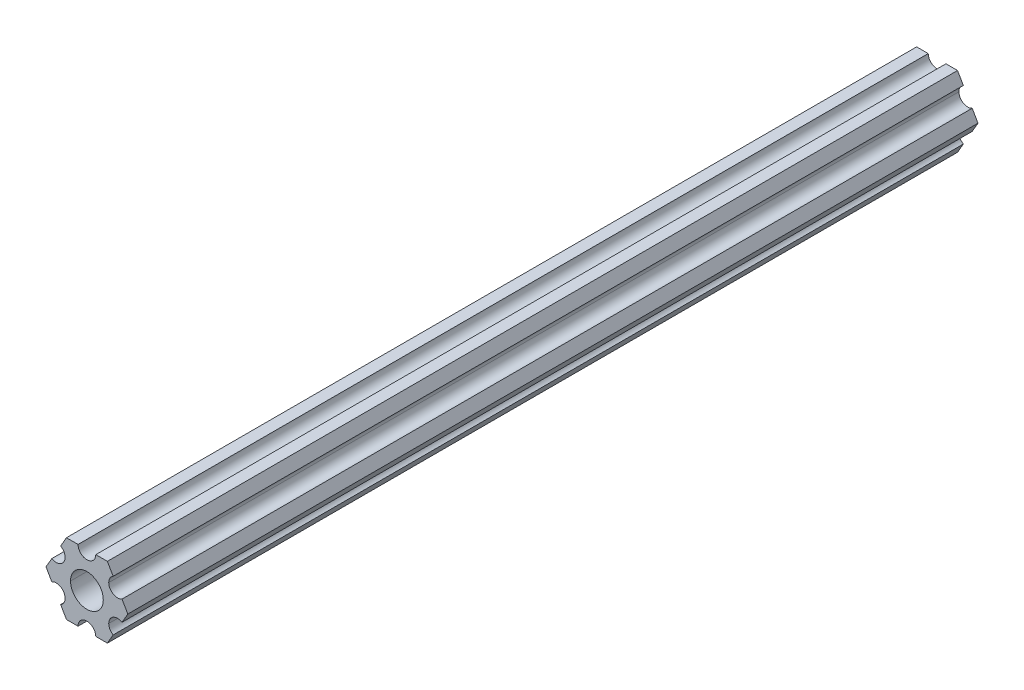
ISO-10303-21;
HEADER;
FILE_DESCRIPTION(('STEP AP214'),'2;1');
FILE_NAME('part.step','',(''),(''),'','','');
FILE_SCHEMA(('AUTOMOTIVE_DESIGN { 1 0 10303 214 1 1 1 1 }'));
ENDSEC;
DATA;
#1=APPLICATION_CONTEXT('core data for automotive mechanical design processes');
#2=APPLICATION_PROTOCOL_DEFINITION('international standard','automotive_design',2000,#1);
#3=PRODUCT_CONTEXT('',#1,'mechanical');
#4=PRODUCT('Part','Part','',(#3));
#5=PRODUCT_RELATED_PRODUCT_CATEGORY('part','',(#4));
#6=PRODUCT_DEFINITION_FORMATION('','',#4);
#7=PRODUCT_DEFINITION_CONTEXT('part definition',#1,'design');
#8=PRODUCT_DEFINITION('design','',#6,#7);
#9=PRODUCT_DEFINITION_SHAPE('','',#8);
#10=(LENGTH_UNIT() NAMED_UNIT(*) SI_UNIT(.MILLI.,.METRE.));
#11=(NAMED_UNIT(*) PLANE_ANGLE_UNIT() SI_UNIT($,.RADIAN.));
#12=(NAMED_UNIT(*) SI_UNIT($,.STERADIAN.) SOLID_ANGLE_UNIT());
#13=UNCERTAINTY_MEASURE_WITH_UNIT(LENGTH_MEASURE(1.E-05),#10,'distance_accuracy_value','');
#14=(GEOMETRIC_REPRESENTATION_CONTEXT(3) GLOBAL_UNCERTAINTY_ASSIGNED_CONTEXT((#13)) GLOBAL_UNIT_ASSIGNED_CONTEXT((#10,
#11,#12)) REPRESENTATION_CONTEXT('',''));
#15=CARTESIAN_POINT('',(0.,0.,0.));
#16=DIRECTION('',(0.,0.,1.));
#17=DIRECTION('',(1.,0.,0.));
#18=AXIS2_PLACEMENT_3D('',#15,#16,#17);
#19=CARTESIAN_POINT('',(0.,0.,304.8));
#20=DIRECTION('',(0.,0.,-1.));
#21=DIRECTION('',(-1.,0.,0.));
#22=AXIS2_PLACEMENT_3D('',#19,#20,#21);
#23=CYLINDRICAL_SURFACE('',#22,2.9337);
#24=DIRECTION('',(0.,0.,-1.));
#25=VECTOR('',#24,1.);
#26=CARTESIAN_POINT('',(2.9337,0.,304.8));
#27=LINE('',#26,#25);
#28=CARTESIAN_POINT('',(2.9337,0.,304.8));
#29=VERTEX_POINT('',#28);
#30=CARTESIAN_POINT('',(2.9337,0.,152.4));
#31=VERTEX_POINT('',#30);
#32=EDGE_CURVE('E258',#29,#31,#27,.T.);
#33=ORIENTED_EDGE('',*,*,#32,.T.);
#34=CARTESIAN_POINT('',(0.,0.,152.4));
#35=DIRECTION('',(0.,0.,1.));
#36=DIRECTION('',(1.,0.,0.));
#37=AXIS2_PLACEMENT_3D('',#34,#35,#36);
#38=CIRCLE('',#37,2.9337);
#39=CARTESIAN_POINT('',(-2.9337,0.,152.4));
#40=VERTEX_POINT('',#39);
#41=EDGE_CURVE('E73',#31,#40,#38,.F.);
#42=ORIENTED_EDGE('',*,*,#41,.T.);
#43=DIRECTION('',(0.,0.,-1.));
#44=VECTOR('',#43,1.);
#45=CARTESIAN_POINT('',(-2.9337,0.,304.8));
#46=LINE('',#45,#44);
#47=CARTESIAN_POINT('',(-2.9337,0.,304.8));
#48=VERTEX_POINT('',#47);
#49=EDGE_CURVE('E406',#48,#40,#46,.T.);
#50=ORIENTED_EDGE('',*,*,#49,.F.);
#51=CARTESIAN_POINT('',(0.,0.,304.8));
#52=DIRECTION('',(0.,0.,1.));
#53=DIRECTION('',(1.,0.,0.));
#54=AXIS2_PLACEMENT_3D('',#51,#52,#53);
#55=CIRCLE('',#54,2.9337);
#56=EDGE_CURVE('E59',#48,#29,#55,.T.);
#57=ORIENTED_EDGE('',*,*,#56,.T.);
#58=EDGE_LOOP('',(#33,#42,#50,#57));
#59=FACE_BOUND('',#58,.T.);
#60=ADVANCED_FACE('F50',(#59),#23,.F.);
#61=CARTESIAN_POINT('',(5.49926150638082,-3.17499966684067,304.8));
#62=DIRECTION('',(0.,0.,-1.));
#63=DIRECTION('',(-1.,0.,0.));
#64=AXIS2_PLACEMENT_3D('',#61,#62,#63);
#65=CYLINDRICAL_SURFACE('',#64,1.5875);
#66=DIRECTION('',(0.,0.,-1.));
#67=VECTOR('',#66,1.);
#68=CARTESIAN_POINT('',(3.91176150638082,-3.17499966684067,304.8));
#69=LINE('',#68,#67);
#70=CARTESIAN_POINT('',(3.91176150638082,-3.17499966684067,304.8));
#71=VERTEX_POINT('',#70);
#72=CARTESIAN_POINT('',(3.91176150638082,-3.17499966684067,152.4));
#73=VERTEX_POINT('',#72);
#74=EDGE_CURVE('E262',#71,#73,#69,.T.);
#75=ORIENTED_EDGE('',*,*,#74,.T.);
#76=CARTESIAN_POINT('',(5.49926150638082,-3.17499966684067,152.4));
#77=DIRECTION('',(0.,0.,1.));
#78=DIRECTION('',(1.,0.,0.));
#79=AXIS2_PLACEMENT_3D('',#76,#77,#78);
#80=CIRCLE('',#79,1.5875);
#81=CARTESIAN_POINT('',(6.29301142309098,-1.80018429024546,152.4));
#82=VERTEX_POINT('',#81);
#83=EDGE_CURVE('E66',#73,#82,#80,.F.);
#84=ORIENTED_EDGE('',*,*,#83,.T.);
#85=DIRECTION('',(0.,0.,-1.));
#86=VECTOR('',#85,1.);
#87=CARTESIAN_POINT('',(6.29301142309098,-1.80018429024546,304.8));
#88=LINE('',#87,#86);
#89=CARTESIAN_POINT('',(6.29301142309098,-1.80018429024546,304.8));
#90=VERTEX_POINT('',#89);
#91=EDGE_CURVE('E298',#90,#82,#88,.T.);
#92=ORIENTED_EDGE('',*,*,#91,.F.);
#93=CARTESIAN_POINT('',(5.49926150638082,-3.17499966684067,304.8));
#94=DIRECTION('',(0.,0.,-1.));
#95=DIRECTION('',(1.,0.,0.));
#96=AXIS2_PLACEMENT_3D('',#93,#94,#95);
#97=CIRCLE('',#96,1.5875);
#98=EDGE_CURVE('E285',#71,#90,#97,.T.);
#99=ORIENTED_EDGE('',*,*,#98,.F.);
#100=EDGE_LOOP('',(#75,#84,#92,#99));
#101=FACE_BOUND('',#100,.T.);
#102=ADVANCED_FACE('F520',(#101),#65,.F.);
#103=CARTESIAN_POINT('',(5.49926112168156,3.17500033315934,304.8));
#104=DIRECTION('',(0.,0.,-1.));
#105=DIRECTION('',(-1.,0.,0.));
#106=AXIS2_PLACEMENT_3D('',#103,#104,#105);
#107=CYLINDRICAL_SURFACE('',#106,1.5875);
#108=DIRECTION('',(0.,0.,-1.));
#109=VECTOR('',#108,1.);
#110=CARTESIAN_POINT('',(3.91176112168156,3.17500033315934,304.8));
#111=LINE('',#110,#109);
#112=CARTESIAN_POINT('',(3.91176112168156,3.17500033315934,304.8));
#113=VERTEX_POINT('',#112);
#114=CARTESIAN_POINT('',(3.91176112168156,3.17500033315934,152.4));
#115=VERTEX_POINT('',#114);
#116=EDGE_CURVE('E347',#113,#115,#111,.T.);
#117=ORIENTED_EDGE('',*,*,#116,.T.);
#118=CARTESIAN_POINT('',(5.49926112168156,3.17500033315934,152.4));
#119=DIRECTION('',(0.,0.,1.));
#120=DIRECTION('',(1.,0.,0.));
#121=AXIS2_PLACEMENT_3D('',#118,#119,#120);
#122=CIRCLE('',#121,1.5875);
#123=CARTESIAN_POINT('',(4.70551103839172,4.54981561357972,152.4));
#124=VERTEX_POINT('',#123);
#125=EDGE_CURVE('E472',#115,#124,#122,.F.);
#126=ORIENTED_EDGE('',*,*,#125,.T.);
#127=DIRECTION('',(0.,0.,-1.));
#128=VECTOR('',#127,1.);
#129=CARTESIAN_POINT('',(4.70551103839172,4.54981561357972,304.8));
#130=LINE('',#129,#128);
#131=CARTESIAN_POINT('',(4.70551103839172,4.54981561357972,304.8));
#132=VERTEX_POINT('',#131);
#133=EDGE_CURVE('E280',#132,#124,#130,.T.);
#134=ORIENTED_EDGE('',*,*,#133,.F.);
#135=CARTESIAN_POINT('',(5.49926112168156,3.17500033315934,304.8));
#136=DIRECTION('',(0.,0.,-1.));
#137=DIRECTION('',(1.,0.,0.));
#138=AXIS2_PLACEMENT_3D('',#135,#136,#137);
#139=CIRCLE('',#138,1.5875);
#140=EDGE_CURVE('E304',#113,#132,#139,.T.);
#141=ORIENTED_EDGE('',*,*,#140,.F.);
#142=EDGE_LOOP('',(#117,#126,#134,#141));
#143=FACE_BOUND('',#142,.T.);
#144=ADVANCED_FACE('F511',(#143),#107,.F.);
#145=CARTESIAN_POINT('',(5.49926112168156,3.17500033315934,304.8));
#146=DIRECTION('',(0.,0.,1.));
#147=DIRECTION('',(1.,0.,0.));
#148=AXIS2_PLACEMENT_3D('',#145,#146,#147);
#149=PLANE('',#148);
#150=DIRECTION('',(0.499999947533953,0.866025434075723,0.));
#151=VECTOR('',#150,1.);
#152=CARTESIAN_POINT('',(6.29301142309098,-1.80018429024546,304.8));
#153=LINE('',#152,#151);
#154=CARTESIAN_POINT('',(7.33234841870827,4.44212519169686E-07,304.8));
#155=VERTEX_POINT('',#154);
#156=EDGE_CURVE('E355',#90,#155,#153,.T.);
#157=ORIENTED_EDGE('',*,*,#156,.T.);
#158=DIRECTION('',(-0.500000052466056,0.866025373493145,0.));
#159=VECTOR('',#158,1.);
#160=CARTESIAN_POINT('',(7.33234841870827,4.44212519169686E-07,304.8));
#161=LINE('',#160,#159);
#162=CARTESIAN_POINT('',(6.29301120497139,1.80018505273894,304.8));
#163=VERTEX_POINT('',#162);
#164=EDGE_CURVE('E303',#155,#163,#161,.T.);
#165=ORIENTED_EDGE('',*,*,#164,.T.);
#166=CARTESIAN_POINT('',(5.49926112168156,3.17500033315934,304.8));
#167=DIRECTION('',(0.,0.,-1.));
#168=DIRECTION('',(1.,0.,0.));
#169=AXIS2_PLACEMENT_3D('',#166,#167,#168);
#170=CIRCLE('',#169,1.5875);
#171=EDGE_CURVE('E299',#163,#113,#170,.T.);
#172=ORIENTED_EDGE('',*,*,#171,.T.);
#173=ORIENTED_EDGE('',*,*,#140,.T.);
#174=DIRECTION('',(-0.500000052466046,0.866025373493151,0.));
#175=VECTOR('',#174,1.);
#176=CARTESIAN_POINT('',(4.70551103839172,4.54981561357972,304.8));
#177=LINE('',#176,#175);
#178=CARTESIAN_POINT('',(3.66617382465481,6.35000022210627,304.8));
#179=VERTEX_POINT('',#178);
#180=EDGE_CURVE('E362',#132,#179,#177,.T.);
#181=ORIENTED_EDGE('',*,*,#180,.T.);
#182=DIRECTION('',(-1.,-6.05825850611185E-08,0.));
#183=VECTOR('',#182,1.);
#184=CARTESIAN_POINT('',(3.66617382465481,6.35000022210627,304.8));
#185=LINE('',#184,#183);
#186=CARTESIAN_POINT('',(1.58749961530074,6.35000009617482,304.8));
#187=VERTEX_POINT('',#186);
#188=EDGE_CURVE('E368',#179,#187,#185,.T.);
#189=ORIENTED_EDGE('',*,*,#188,.T.);
#190=CARTESIAN_POINT('',(-3.84699260060323E-07,6.35,304.8));
#191=DIRECTION('',(0.,0.,-1.));
#192=DIRECTION('',(1.,0.,0.));
#193=AXIS2_PLACEMENT_3D('',#190,#191,#192);
#194=CIRCLE('',#193,1.5875);
#195=CARTESIAN_POINT('',(-1.58750038469926,6.34999990382519,304.8));
#196=VERTEX_POINT('',#195);
#197=EDGE_CURVE('E374',#187,#196,#194,.T.);
#198=ORIENTED_EDGE('',*,*,#197,.T.);
#199=DIRECTION('',(-1.,-6.05825963273174E-08,0.));
#200=VECTOR('',#199,1.);
#201=CARTESIAN_POINT('',(-1.58750038469926,6.34999990382518,304.8));
#202=LINE('',#201,#200);
#203=CARTESIAN_POINT('',(-3.66617459405349,6.3499997778937,304.8));
#204=VERTEX_POINT('',#203);
#205=EDGE_CURVE('E387',#196,#204,#202,.T.);
#206=ORIENTED_EDGE('',*,*,#205,.T.);
#207=DIRECTION('',(-0.499999947533943,-0.866025434075729,0.));
#208=VECTOR('',#207,1.);
#209=CARTESIAN_POINT('',(-3.66617459405349,6.3499997778937,304.8));
#210=LINE('',#209,#208);
#211=CARTESIAN_POINT('',(-4.70551158967065,4.54981504343587,304.8));
#212=VERTEX_POINT('',#211);
#213=EDGE_CURVE('E244',#204,#212,#210,.T.);
#214=ORIENTED_EDGE('',*,*,#213,.T.);
#215=CARTESIAN_POINT('',(-5.49926150638082,3.17499966684067,304.8));
#216=DIRECTION('',(0.,0.,-1.));
#217=DIRECTION('',(1.,0.,0.));
#218=AXIS2_PLACEMENT_3D('',#215,#216,#217);
#219=CIRCLE('',#218,1.5875);
#220=CARTESIAN_POINT('',(-6.29301142309098,1.80018429024547,304.8));
#221=VERTEX_POINT('',#220);
#222=EDGE_CURVE('E273',#212,#221,#219,.T.);
#223=ORIENTED_EDGE('',*,*,#222,.T.);
#224=DIRECTION('',(-0.499999947533951,-0.866025434075724,0.));
#225=VECTOR('',#224,1.);
#226=CARTESIAN_POINT('',(-6.29301142309098,1.80018429024547,304.8));
#227=LINE('',#226,#225);
#228=CARTESIAN_POINT('',(-7.33234841870827,-4.44212523790841E-07,304.8));
#229=VERTEX_POINT('',#228);
#230=EDGE_CURVE('E269',#221,#229,#227,.T.);
#231=ORIENTED_EDGE('',*,*,#230,.T.);
#232=DIRECTION('',(0.500000052466045,-0.866025373493151,0.));
#233=VECTOR('',#232,1.);
#234=CARTESIAN_POINT('',(-7.33234841870827,-4.44212523790841E-07,304.8));
#235=LINE('',#234,#233);
#236=CARTESIAN_POINT('',(-6.29301120497141,-1.80018505273897,304.8));
#237=VERTEX_POINT('',#236);
#238=EDGE_CURVE('E274',#229,#237,#235,.T.);
#239=ORIENTED_EDGE('',*,*,#238,.T.);
#240=CARTESIAN_POINT('',(-5.49926112168156,-3.17500033315934,304.8));
#241=DIRECTION('',(0.,0.,-1.));
#242=DIRECTION('',(1.,0.,0.));
#243=AXIS2_PLACEMENT_3D('',#240,#241,#242);
#244=CIRCLE('',#243,1.5875);
#245=CARTESIAN_POINT('',(-4.70551103839172,-4.54981561357972,304.8));
#246=VERTEX_POINT('',#245);
#247=EDGE_CURVE('E289',#237,#246,#244,.T.);
#248=ORIENTED_EDGE('',*,*,#247,.T.);
#249=DIRECTION('',(0.500000052466045,-0.866025373493152,0.));
#250=VECTOR('',#249,1.);
#251=CARTESIAN_POINT('',(-4.70551103839172,-4.54981561357972,304.8));
#252=LINE('',#251,#250);
#253=CARTESIAN_POINT('',(-3.66617382465481,-6.35000022210628,304.8));
#254=VERTEX_POINT('',#253);
#255=EDGE_CURVE('E343',#246,#254,#252,.T.);
#256=ORIENTED_EDGE('',*,*,#255,.T.);
#257=DIRECTION('',(1.,6.05825854783851E-08,0.));
#258=VECTOR('',#257,1.);
#259=CARTESIAN_POINT('',(-3.66617382465481,-6.35000022210628,304.8));
#260=LINE('',#259,#258);
#261=CARTESIAN_POINT('',(-1.58749961530073,-6.35000009617482,304.8));
#262=VERTEX_POINT('',#261);
#263=EDGE_CURVE('E348',#254,#262,#260,.T.);
#264=ORIENTED_EDGE('',*,*,#263,.T.);
#265=CARTESIAN_POINT('',(3.8469926204343E-07,-6.35,304.8));
#266=DIRECTION('',(0.,0.,-1.));
#267=DIRECTION('',(1.,0.,0.));
#268=AXIS2_PLACEMENT_3D('',#265,#266,#267);
#269=CIRCLE('',#268,1.5875);
#270=CARTESIAN_POINT('',(1.58750038469926,-6.34999990382518,304.8));
#271=VERTEX_POINT('',#270);
#272=EDGE_CURVE('E267',#262,#271,#269,.T.);
#273=ORIENTED_EDGE('',*,*,#272,.T.);
#274=DIRECTION('',(1.,6.05825721258438E-08,0.));
#275=VECTOR('',#274,1.);
#276=CARTESIAN_POINT('',(1.58750038469926,-6.34999990382518,304.8));
#277=LINE('',#276,#275);
#278=CARTESIAN_POINT('',(3.66617459405346,-6.34999977789375,304.8));
#279=VERTEX_POINT('',#278);
#280=EDGE_CURVE('E263',#271,#279,#277,.T.);
#281=ORIENTED_EDGE('',*,*,#280,.T.);
#282=DIRECTION('',(0.499999947533941,0.86602543407573,0.));
#283=VECTOR('',#282,1.);
#284=CARTESIAN_POINT('',(3.66617459405346,-6.34999977789375,304.8));
#285=LINE('',#284,#283);
#286=CARTESIAN_POINT('',(4.70551158967065,-4.54981504343587,304.8));
#287=VERTEX_POINT('',#286);
#288=EDGE_CURVE('E268',#279,#287,#285,.T.);
#289=ORIENTED_EDGE('',*,*,#288,.T.);
#290=CARTESIAN_POINT('',(5.49926150638082,-3.17499966684067,304.8));
#291=DIRECTION('',(0.,0.,-1.));
#292=DIRECTION('',(1.,0.,0.));
#293=AXIS2_PLACEMENT_3D('',#290,#291,#292);
#294=CIRCLE('',#293,1.5875);
#295=EDGE_CURVE('E281',#287,#71,#294,.T.);
#296=ORIENTED_EDGE('',*,*,#295,.T.);
#297=ORIENTED_EDGE('',*,*,#98,.T.);
#298=EDGE_LOOP('',(#157,#165,#172,#173,#181,#189,#198,#206,#214,#223,#231,#239,#248,#256,#264,
#273,#281,#289,#296,#297));
#299=FACE_BOUND('',#298,.T.);
#300=ORIENTED_EDGE('',*,*,#56,.F.);
#301=CARTESIAN_POINT('',(0.,0.,304.8));
#302=DIRECTION('',(0.,0.,1.));
#303=DIRECTION('',(1.,0.,0.));
#304=AXIS2_PLACEMENT_3D('',#301,#302,#303);
#305=CIRCLE('',#304,2.9337);
#306=EDGE_CURVE('E402',#29,#48,#305,.T.);
#307=ORIENTED_EDGE('',*,*,#306,.F.);
#308=EDGE_LOOP('',(#300,#307));
#309=FACE_BOUND('',#308,.T.);
#310=ADVANCED_FACE('F494',(#299,#309),#149,.T.);
#311=CARTESIAN_POINT('',(6.29301142309098,-1.80018429024546,304.8));
#312=DIRECTION('',(-0.866025434075723,0.499999947533953,0.));
#313=DIRECTION('',(0.,0.,1.));
#314=AXIS2_PLACEMENT_3D('',#311,#312,#313);
#315=PLANE('',#314);
#316=ORIENTED_EDGE('',*,*,#91,.T.);
#317=DIRECTION('',(0.499999947533953,0.866025434075723,0.));
#318=VECTOR('',#317,1.);
#319=CARTESIAN_POINT('',(6.29301142309098,-1.80018429024546,152.4));
#320=LINE('',#319,#318);
#321=CARTESIAN_POINT('',(7.33234841870827,4.44212509336798E-07,152.4));
#322=VERTEX_POINT('',#321);
#323=EDGE_CURVE('E462',#82,#322,#320,.T.);
#324=ORIENTED_EDGE('',*,*,#323,.T.);
#325=DIRECTION('',(0.,0.,-1.));
#326=VECTOR('',#325,1.);
#327=CARTESIAN_POINT('',(7.33234841870827,4.44212519169686E-07,304.8));
#328=LINE('',#327,#326);
#329=EDGE_CURVE('E279',#155,#322,#328,.T.);
#330=ORIENTED_EDGE('',*,*,#329,.F.);
#331=ORIENTED_EDGE('',*,*,#156,.F.);
#332=EDGE_LOOP('',(#316,#324,#330,#331));
#333=FACE_BOUND('',#332,.T.);
#334=ADVANCED_FACE('F510',(#333),#315,.F.);
#335=CARTESIAN_POINT('',(7.33234841870827,4.44212519169686E-07,304.8));
#336=DIRECTION('',(-0.866025373493145,-0.500000052466057,0.));
#337=DIRECTION('',(-0.500000052466057,0.866025373493145,0.));
#338=AXIS2_PLACEMENT_3D('',#335,#336,#337);
#339=PLANE('',#338);
#340=ORIENTED_EDGE('',*,*,#329,.T.);
#341=DIRECTION('',(-0.500000052466057,0.866025373493145,0.));
#342=VECTOR('',#341,1.);
#343=CARTESIAN_POINT('',(7.33234841870827,4.44212519169686E-07,152.4));
#344=LINE('',#343,#342);
#345=CARTESIAN_POINT('',(6.2930112049714,1.80018505273894,152.4));
#346=VERTEX_POINT('',#345);
#347=EDGE_CURVE('E465',#322,#346,#344,.T.);
#348=ORIENTED_EDGE('',*,*,#347,.T.);
#349=DIRECTION('',(0.,0.,-1.));
#350=VECTOR('',#349,1.);
#351=CARTESIAN_POINT('',(6.29301120497139,1.80018505273894,304.8));
#352=LINE('',#351,#350);
#353=EDGE_CURVE('E275',#163,#346,#352,.T.);
#354=ORIENTED_EDGE('',*,*,#353,.F.);
#355=ORIENTED_EDGE('',*,*,#164,.F.);
#356=EDGE_LOOP('',(#340,#348,#354,#355));
#357=FACE_BOUND('',#356,.T.);
#358=ADVANCED_FACE('F52',(#357),#339,.F.);
#359=CARTESIAN_POINT('',(5.49926112168156,3.17500033315934,304.8));
#360=DIRECTION('',(0.,0.,-1.));
#361=DIRECTION('',(-1.,0.,0.));
#362=AXIS2_PLACEMENT_3D('',#359,#360,#361);
#363=CYLINDRICAL_SURFACE('',#362,1.5875);
#364=ORIENTED_EDGE('',*,*,#353,.T.);
#365=CARTESIAN_POINT('',(5.49926112168156,3.17500033315934,152.4));
#366=DIRECTION('',(0.,0.,1.));
#367=DIRECTION('',(1.,0.,0.));
#368=AXIS2_PLACEMENT_3D('',#365,#366,#367);
#369=CIRCLE('',#368,1.5875);
#370=EDGE_CURVE('E468',#346,#115,#369,.F.);
#371=ORIENTED_EDGE('',*,*,#370,.T.);
#372=ORIENTED_EDGE('',*,*,#116,.F.);
#373=ORIENTED_EDGE('',*,*,#171,.F.);
#374=EDGE_LOOP('',(#364,#371,#372,#373));
#375=FACE_BOUND('',#374,.T.);
#376=ADVANCED_FACE('F537',(#375),#363,.F.);
#377=CARTESIAN_POINT('',(4.70551103839172,4.54981561357972,304.8));
#378=DIRECTION('',(-0.866025373493151,-0.500000052466046,0.));
#379=DIRECTION('',(-0.500000052466046,0.866025373493151,0.));
#380=AXIS2_PLACEMENT_3D('',#377,#378,#379);
#381=PLANE('',#380);
#382=ORIENTED_EDGE('',*,*,#133,.T.);
#383=DIRECTION('',(-0.500000052466046,0.866025373493151,0.));
#384=VECTOR('',#383,1.);
#385=CARTESIAN_POINT('',(4.70551103839172,4.54981561357972,152.4));
#386=LINE('',#385,#384);
#387=CARTESIAN_POINT('',(3.66617382465481,6.3500002221064,152.4));
#388=VERTEX_POINT('',#387);
#389=EDGE_CURVE('E476',#124,#388,#386,.T.);
#390=ORIENTED_EDGE('',*,*,#389,.T.);
#391=DIRECTION('',(0.,0.,-1.));
#392=VECTOR('',#391,1.);
#393=CARTESIAN_POINT('',(3.66617382465481,6.35000022210627,304.8));
#394=LINE('',#393,#392);
#395=EDGE_CURVE('E308',#179,#388,#394,.T.);
#396=ORIENTED_EDGE('',*,*,#395,.F.);
#397=ORIENTED_EDGE('',*,*,#180,.F.);
#398=EDGE_LOOP('',(#382,#390,#396,#397));
#399=FACE_BOUND('',#398,.T.);
#400=ADVANCED_FACE('F540',(#399),#381,.F.);
#401=CARTESIAN_POINT('',(3.66617382465481,6.35000022210627,304.8));
#402=DIRECTION('',(6.05825850611185E-08,-1.,0.));
#403=DIRECTION('',(0.,0.,-1.));
#404=AXIS2_PLACEMENT_3D('',#401,#402,#403);
#405=PLANE('',#404);
#406=ORIENTED_EDGE('',*,*,#395,.T.);
#407=DIRECTION('',(0.999999999999998,6.05825963288247E-08,0.));
#408=VECTOR('',#407,1.);
#409=CARTESIAN_POINT('',(-3.84699486688041E-07,6.35000000000005,152.4));
#410=LINE('',#409,#408);
#411=CARTESIAN_POINT('',(1.58749961530074,6.35000009617492,152.4));
#412=VERTEX_POINT('',#411);
#413=EDGE_CURVE('E240',#412,#388,#410,.T.);
#414=ORIENTED_EDGE('',*,*,#413,.F.);
#415=DIRECTION('',(0.,0.,-1.));
#416=VECTOR('',#415,1.);
#417=CARTESIAN_POINT('',(1.58749961530074,6.35000009617482,304.8));
#418=LINE('',#417,#416);
#419=EDGE_CURVE('E252',#187,#412,#418,.T.);
#420=ORIENTED_EDGE('',*,*,#419,.F.);
#421=ORIENTED_EDGE('',*,*,#188,.F.);
#422=EDGE_LOOP('',(#406,#414,#420,#421));
#423=FACE_BOUND('',#422,.T.);
#424=ADVANCED_FACE('F501',(#423),#405,.F.);
#425=CARTESIAN_POINT('',(-3.84699260060323E-07,6.35,304.8));
#426=DIRECTION('',(0.,0.,-1.));
#427=DIRECTION('',(-1.,0.,0.));
#428=AXIS2_PLACEMENT_3D('',#425,#426,#427);
#429=CYLINDRICAL_SURFACE('',#428,1.5875);
#430=ORIENTED_EDGE('',*,*,#419,.T.);
#431=CARTESIAN_POINT('',(-3.84699260060323E-07,6.35,152.4));
#432=DIRECTION('',(0.,0.,1.));
#433=DIRECTION('',(1.,0.,0.));
#434=AXIS2_PLACEMENT_3D('',#431,#432,#433);
#435=CIRCLE('',#434,1.5875);
#436=CARTESIAN_POINT('',(-1.58750038469926,6.34999990382518,152.4));
#437=VERTEX_POINT('',#436);
#438=EDGE_CURVE('E410',#412,#437,#435,.F.);
#439=ORIENTED_EDGE('',*,*,#438,.T.);
#440=DIRECTION('',(0.,0.,-1.));
#441=VECTOR('',#440,1.);
#442=CARTESIAN_POINT('',(-1.58750038469926,6.34999990382519,304.8));
#443=LINE('',#442,#441);
#444=EDGE_CURVE('E238',#196,#437,#443,.T.);
#445=ORIENTED_EDGE('',*,*,#444,.F.);
#446=ORIENTED_EDGE('',*,*,#197,.F.);
#447=EDGE_LOOP('',(#430,#439,#445,#446));
#448=FACE_BOUND('',#447,.T.);
#449=ADVANCED_FACE('F498',(#448),#429,.F.);
#450=CARTESIAN_POINT('',(-1.58750038469926,6.34999990382518,304.8));
#451=DIRECTION('',(6.05825963273174E-08,-1.,0.));
#452=DIRECTION('',(0.,0.,-1.));
#453=AXIS2_PLACEMENT_3D('',#450,#451,#452);
#454=PLANE('',#453);
#455=ORIENTED_EDGE('',*,*,#444,.T.);
#456=CARTESIAN_POINT('',(-3.66617459405349,6.3499997778937,152.4));
#457=VERTEX_POINT('',#456);
#458=EDGE_CURVE('E222',#457,#437,#410,.T.);
#459=ORIENTED_EDGE('',*,*,#458,.F.);
#460=DIRECTION('',(0.,0.,-1.));
#461=VECTOR('',#460,1.);
#462=CARTESIAN_POINT('',(-3.66617459405349,6.3499997778937,304.8));
#463=LINE('',#462,#461);
#464=EDGE_CURVE('E236',#204,#457,#463,.T.);
#465=ORIENTED_EDGE('',*,*,#464,.F.);
#466=ORIENTED_EDGE('',*,*,#205,.F.);
#467=EDGE_LOOP('',(#455,#459,#465,#466));
#468=FACE_BOUND('',#467,.T.);
#469=ADVANCED_FACE('F235',(#468),#454,.F.);
#470=CARTESIAN_POINT('',(-3.66617459405349,6.3499997778937,304.8));
#471=DIRECTION('',(0.866025434075729,-0.499999947533942,0.));
#472=DIRECTION('',(0.,0.,-1.));
#473=AXIS2_PLACEMENT_3D('',#470,#471,#472);
#474=PLANE('',#473);
#475=ORIENTED_EDGE('',*,*,#464,.T.);
#476=DIRECTION('',(-0.499999947533942,-0.866025434075729,0.));
#477=VECTOR('',#476,1.);
#478=CARTESIAN_POINT('',(-3.66617459405349,6.3499997778937,152.4));
#479=LINE('',#478,#477);
#480=CARTESIAN_POINT('',(-4.70551158967065,4.54981504343587,152.4));
#481=VERTEX_POINT('',#480);
#482=EDGE_CURVE('E219',#457,#481,#479,.T.);
#483=ORIENTED_EDGE('',*,*,#482,.T.);
#484=DIRECTION('',(0.,0.,-1.));
#485=VECTOR('',#484,1.);
#486=CARTESIAN_POINT('',(-4.70551158967065,4.54981504343587,304.8));
#487=LINE('',#486,#485);
#488=EDGE_CURVE('E247',#212,#481,#487,.T.);
#489=ORIENTED_EDGE('',*,*,#488,.F.);
#490=ORIENTED_EDGE('',*,*,#213,.F.);
#491=EDGE_LOOP('',(#475,#483,#489,#490));
#492=FACE_BOUND('',#491,.T.);
#493=ADVANCED_FACE('F242',(#492),#474,.F.);
#494=CARTESIAN_POINT('',(-5.49926150638082,3.17499966684067,304.8));
#495=DIRECTION('',(0.,0.,-1.));
#496=DIRECTION('',(-1.,0.,0.));
#497=AXIS2_PLACEMENT_3D('',#494,#495,#496);
#498=CYLINDRICAL_SURFACE('',#497,1.5875);
#499=ORIENTED_EDGE('',*,*,#488,.T.);
#500=CARTESIAN_POINT('',(-5.49926150638082,3.17499966684067,152.4));
#501=DIRECTION('',(0.,0.,1.));
#502=DIRECTION('',(1.,0.,0.));
#503=AXIS2_PLACEMENT_3D('',#500,#501,#502);
#504=CIRCLE('',#503,1.5875);
#505=CARTESIAN_POINT('',(-6.29301142309098,1.80018429024547,152.4));
#506=VERTEX_POINT('',#505);
#507=EDGE_CURVE('E225',#481,#506,#504,.F.);
#508=ORIENTED_EDGE('',*,*,#507,.T.);
#509=DIRECTION('',(0.,0.,-1.));
#510=VECTOR('',#509,1.);
#511=CARTESIAN_POINT('',(-6.29301142309098,1.80018429024547,304.8));
#512=LINE('',#511,#510);
#513=EDGE_CURVE('E254',#221,#506,#512,.T.);
#514=ORIENTED_EDGE('',*,*,#513,.F.);
#515=ORIENTED_EDGE('',*,*,#222,.F.);
#516=EDGE_LOOP('',(#499,#508,#514,#515));
#517=FACE_BOUND('',#516,.T.);
#518=ADVANCED_FACE('F565',(#517),#498,.F.);
#519=CARTESIAN_POINT('',(-6.29301142309098,1.80018429024547,304.8));
#520=DIRECTION('',(0.866025434075724,-0.499999947533952,0.));
#521=DIRECTION('',(0.,0.,-1.));
#522=AXIS2_PLACEMENT_3D('',#519,#520,#521);
#523=PLANE('',#522);
#524=ORIENTED_EDGE('',*,*,#513,.T.);
#525=DIRECTION('',(-0.499999947533952,-0.866025434075724,0.));
#526=VECTOR('',#525,1.);
#527=CARTESIAN_POINT('',(-6.29301142309098,1.80018429024547,152.4));
#528=LINE('',#527,#526);
#529=CARTESIAN_POINT('',(-7.33234841870827,-4.44212524403076E-07,152.4));
#530=VERTEX_POINT('',#529);
#531=EDGE_CURVE('E454',#506,#530,#528,.T.);
#532=ORIENTED_EDGE('',*,*,#531,.T.);
#533=DIRECTION('',(0.,0.,-1.));
#534=VECTOR('',#533,1.);
#535=CARTESIAN_POINT('',(-7.33234841870827,-4.44212523790841E-07,304.8));
#536=LINE('',#535,#534);
#537=EDGE_CURVE('E290',#229,#530,#536,.T.);
#538=ORIENTED_EDGE('',*,*,#537,.F.);
#539=ORIENTED_EDGE('',*,*,#230,.F.);
#540=EDGE_LOOP('',(#524,#532,#538,#539));
#541=FACE_BOUND('',#540,.T.);
#542=ADVANCED_FACE('F557',(#541),#523,.F.);
#543=CARTESIAN_POINT('',(-7.33234841870827,-4.44212523790841E-07,304.8));
#544=DIRECTION('',(0.866025373493151,0.500000052466045,0.));
#545=DIRECTION('',(0.,0.,-1.));
#546=AXIS2_PLACEMENT_3D('',#543,#544,#545);
#547=PLANE('',#546);
#548=ORIENTED_EDGE('',*,*,#537,.T.);
#549=DIRECTION('',(0.500000052466045,-0.866025373493151,0.));
#550=VECTOR('',#549,1.);
#551=CARTESIAN_POINT('',(-7.33234841870827,-4.44212523790841E-07,152.4));
#552=LINE('',#551,#550);
#553=CARTESIAN_POINT('',(-6.29301120497141,-1.80018505273896,152.4));
#554=VERTEX_POINT('',#553);
#555=EDGE_CURVE('E450',#530,#554,#552,.T.);
#556=ORIENTED_EDGE('',*,*,#555,.T.);
#557=DIRECTION('',(0.,0.,-1.));
#558=VECTOR('',#557,1.);
#559=CARTESIAN_POINT('',(-6.29301120497141,-1.80018505273897,304.8));
#560=LINE('',#559,#558);
#561=EDGE_CURVE('E294',#237,#554,#560,.T.);
#562=ORIENTED_EDGE('',*,*,#561,.F.);
#563=ORIENTED_EDGE('',*,*,#238,.F.);
#564=EDGE_LOOP('',(#548,#556,#562,#563));
#565=FACE_BOUND('',#564,.T.);
#566=ADVANCED_FACE('F553',(#565),#547,.F.);
#567=CARTESIAN_POINT('',(-5.49926112168156,-3.17500033315934,304.8));
#568=DIRECTION('',(0.,0.,-1.));
#569=DIRECTION('',(-1.,0.,0.));
#570=AXIS2_PLACEMENT_3D('',#567,#568,#569);
#571=CYLINDRICAL_SURFACE('',#570,1.5875);
#572=ORIENTED_EDGE('',*,*,#561,.T.);
#573=CARTESIAN_POINT('',(-5.49926112168156,-3.17500033315934,152.4));
#574=DIRECTION('',(0.,0.,1.));
#575=DIRECTION('',(1.,0.,0.));
#576=AXIS2_PLACEMENT_3D('',#573,#574,#575);
#577=CIRCLE('',#576,1.5875);
#578=CARTESIAN_POINT('',(-4.70551103839172,-4.54981561357972,152.4));
#579=VERTEX_POINT('',#578);
#580=EDGE_CURVE('E446',#554,#579,#577,.F.);
#581=ORIENTED_EDGE('',*,*,#580,.T.);
#582=DIRECTION('',(0.,0.,-1.));
#583=VECTOR('',#582,1.);
#584=CARTESIAN_POINT('',(-4.70551103839172,-4.54981561357972,304.8));
#585=LINE('',#584,#583);
#586=EDGE_CURVE('E315',#246,#579,#585,.T.);
#587=ORIENTED_EDGE('',*,*,#586,.F.);
#588=ORIENTED_EDGE('',*,*,#247,.F.);
#589=EDGE_LOOP('',(#572,#581,#587,#588));
#590=FACE_BOUND('',#589,.T.);
#591=ADVANCED_FACE('F556',(#590),#571,.F.);
#592=CARTESIAN_POINT('',(-4.70551103839172,-4.54981561357972,304.8));
#593=DIRECTION('',(0.866025373493152,0.500000052466045,0.));
#594=DIRECTION('',(0.,0.,-1.));
#595=AXIS2_PLACEMENT_3D('',#592,#593,#594);
#596=PLANE('',#595);
#597=ORIENTED_EDGE('',*,*,#586,.T.);
#598=DIRECTION('',(0.500000052466045,-0.866025373493152,0.));
#599=VECTOR('',#598,1.);
#600=CARTESIAN_POINT('',(-4.70551103839172,-4.54981561357972,152.4));
#601=LINE('',#600,#599);
#602=CARTESIAN_POINT('',(-3.66617382465481,-6.35000022210628,152.4));
#603=VERTEX_POINT('',#602);
#604=EDGE_CURVE('E442',#579,#603,#601,.T.);
#605=ORIENTED_EDGE('',*,*,#604,.T.);
#606=DIRECTION('',(0.,0.,-1.));
#607=VECTOR('',#606,1.);
#608=CARTESIAN_POINT('',(-3.66617382465481,-6.35000022210628,304.8));
#609=LINE('',#608,#607);
#610=EDGE_CURVE('E356',#254,#603,#609,.T.);
#611=ORIENTED_EDGE('',*,*,#610,.F.);
#612=ORIENTED_EDGE('',*,*,#255,.F.);
#613=EDGE_LOOP('',(#597,#605,#611,#612));
#614=FACE_BOUND('',#613,.T.);
#615=ADVANCED_FACE('F549',(#614),#596,.F.);
#616=CARTESIAN_POINT('',(-3.66617382465481,-6.35000022210628,304.8));
#617=DIRECTION('',(-6.05825854783851E-08,1.,0.));
#618=DIRECTION('',(0.,0.,1.));
#619=AXIS2_PLACEMENT_3D('',#616,#617,#618);
#620=PLANE('',#619);
#621=ORIENTED_EDGE('',*,*,#610,.T.);
#622=DIRECTION('',(0.999999999999998,6.0582585478385E-08,0.));
#623=VECTOR('',#622,1.);
#624=CARTESIAN_POINT('',(-3.66617382465481,-6.35000022210628,152.4));
#625=LINE('',#624,#623);
#626=CARTESIAN_POINT('',(-1.58749961530073,-6.35000009617482,152.4));
#627=VERTEX_POINT('',#626);
#628=EDGE_CURVE('E438',#603,#627,#625,.T.);
#629=ORIENTED_EDGE('',*,*,#628,.T.);
#630=DIRECTION('',(0.,0.,-1.));
#631=VECTOR('',#630,1.);
#632=CARTESIAN_POINT('',(-1.58749961530073,-6.35000009617482,304.8));
#633=LINE('',#632,#631);
#634=EDGE_CURVE('E359',#262,#627,#633,.T.);
#635=ORIENTED_EDGE('',*,*,#634,.F.);
#636=ORIENTED_EDGE('',*,*,#263,.F.);
#637=EDGE_LOOP('',(#621,#629,#635,#636));
#638=FACE_BOUND('',#637,.T.);
#639=ADVANCED_FACE('F545',(#638),#620,.F.);
#640=CARTESIAN_POINT('',(3.8469926204343E-07,-6.35,304.8));
#641=DIRECTION('',(0.,0.,-1.));
#642=DIRECTION('',(-1.,0.,0.));
#643=AXIS2_PLACEMENT_3D('',#640,#641,#642);
#644=CYLINDRICAL_SURFACE('',#643,1.5875);
#645=ORIENTED_EDGE('',*,*,#634,.T.);
#646=CARTESIAN_POINT('',(3.8469926204343E-07,-6.35,152.4));
#647=DIRECTION('',(0.,0.,1.));
#648=DIRECTION('',(1.,0.,0.));
#649=AXIS2_PLACEMENT_3D('',#646,#647,#648);
#650=CIRCLE('',#649,1.5875);
#651=CARTESIAN_POINT('',(1.58750038469926,-6.34999990382518,152.4));
#652=VERTEX_POINT('',#651);
#653=EDGE_CURVE('E430',#627,#652,#650,.F.);
#654=ORIENTED_EDGE('',*,*,#653,.T.);
#655=DIRECTION('',(0.,0.,-1.));
#656=VECTOR('',#655,1.);
#657=CARTESIAN_POINT('',(1.58750038469926,-6.34999990382518,304.8));
#658=LINE('',#657,#656);
#659=EDGE_CURVE('E320',#271,#652,#658,.T.);
#660=ORIENTED_EDGE('',*,*,#659,.F.);
#661=ORIENTED_EDGE('',*,*,#272,.F.);
#662=EDGE_LOOP('',(#645,#654,#660,#661));
#663=FACE_BOUND('',#662,.T.);
#664=ADVANCED_FACE('F548',(#663),#644,.F.);
#665=CARTESIAN_POINT('',(1.58750038469926,-6.34999990382518,304.8));
#666=DIRECTION('',(-6.05825721258438E-08,1.,0.));
#667=DIRECTION('',(0.,0.,1.));
#668=AXIS2_PLACEMENT_3D('',#665,#666,#667);
#669=PLANE('',#668);
#670=ORIENTED_EDGE('',*,*,#659,.T.);
#671=DIRECTION('',(0.999999999999998,6.05825721258437E-08,0.));
#672=VECTOR('',#671,1.);
#673=CARTESIAN_POINT('',(1.58750038469926,-6.34999990382518,152.4));
#674=LINE('',#673,#672);
#675=CARTESIAN_POINT('',(3.66617459405346,-6.34999977789375,152.4));
#676=VERTEX_POINT('',#675);
#677=EDGE_CURVE('E426',#652,#676,#674,.T.);
#678=ORIENTED_EDGE('',*,*,#677,.T.);
#679=DIRECTION('',(0.,0.,-1.));
#680=VECTOR('',#679,1.);
#681=CARTESIAN_POINT('',(3.66617459405346,-6.34999977789375,304.8));
#682=LINE('',#681,#680);
#683=EDGE_CURVE('E316',#279,#676,#682,.T.);
#684=ORIENTED_EDGE('',*,*,#683,.F.);
#685=ORIENTED_EDGE('',*,*,#280,.F.);
#686=EDGE_LOOP('',(#670,#678,#684,#685));
#687=FACE_BOUND('',#686,.T.);
#688=ADVANCED_FACE('F536',(#687),#669,.F.);
#689=CARTESIAN_POINT('',(3.66617459405346,-6.34999977789375,304.8));
#690=DIRECTION('',(-0.86602543407573,0.499999947533941,0.));
#691=DIRECTION('',(0.,0.,1.));
#692=AXIS2_PLACEMENT_3D('',#689,#690,#691);
#693=PLANE('',#692);
#694=ORIENTED_EDGE('',*,*,#683,.T.);
#695=DIRECTION('',(0.499999947533941,0.86602543407573,0.));
#696=VECTOR('',#695,1.);
#697=CARTESIAN_POINT('',(3.66617459405346,-6.34999977789375,152.4));
#698=LINE('',#697,#696);
#699=CARTESIAN_POINT('',(4.70551158967065,-4.54981504343587,152.4));
#700=VERTEX_POINT('',#699);
#701=EDGE_CURVE('E422',#676,#700,#698,.T.);
#702=ORIENTED_EDGE('',*,*,#701,.T.);
#703=DIRECTION('',(0.,0.,-1.));
#704=VECTOR('',#703,1.);
#705=CARTESIAN_POINT('',(4.70551158967065,-4.54981504343587,304.8));
#706=LINE('',#705,#704);
#707=EDGE_CURVE('E321',#287,#700,#706,.T.);
#708=ORIENTED_EDGE('',*,*,#707,.F.);
#709=ORIENTED_EDGE('',*,*,#288,.F.);
#710=EDGE_LOOP('',(#694,#702,#708,#709));
#711=FACE_BOUND('',#710,.T.);
#712=ADVANCED_FACE('F421',(#711),#693,.F.);
#713=CARTESIAN_POINT('',(5.49926150638082,-3.17499966684067,304.8));
#714=DIRECTION('',(0.,0.,-1.));
#715=DIRECTION('',(-1.,0.,0.));
#716=AXIS2_PLACEMENT_3D('',#713,#714,#715);
#717=CYLINDRICAL_SURFACE('',#716,1.5875);
#718=ORIENTED_EDGE('',*,*,#707,.T.);
#719=CARTESIAN_POINT('',(5.49926150638082,-3.17499966684067,152.4));
#720=DIRECTION('',(0.,0.,1.));
#721=DIRECTION('',(1.,0.,0.));
#722=AXIS2_PLACEMENT_3D('',#719,#720,#721);
#723=CIRCLE('',#722,1.5875);
#724=EDGE_CURVE('E418',#700,#73,#723,.F.);
#725=ORIENTED_EDGE('',*,*,#724,.T.);
#726=ORIENTED_EDGE('',*,*,#74,.F.);
#727=ORIENTED_EDGE('',*,*,#295,.F.);
#728=EDGE_LOOP('',(#718,#725,#726,#727));
#729=FACE_BOUND('',#728,.T.);
#730=ADVANCED_FACE('F416',(#729),#717,.F.);
#731=CARTESIAN_POINT('',(0.,0.,304.8));
#732=DIRECTION('',(0.,0.,-1.));
#733=DIRECTION('',(-1.,0.,0.));
#734=AXIS2_PLACEMENT_3D('',#731,#732,#733);
#735=CYLINDRICAL_SURFACE('',#734,2.9337);
#736=ORIENTED_EDGE('',*,*,#49,.T.);
#737=CARTESIAN_POINT('',(0.,0.,152.4));
#738=DIRECTION('',(0.,0.,1.));
#739=DIRECTION('',(1.,0.,0.));
#740=AXIS2_PLACEMENT_3D('',#737,#738,#739);
#741=CIRCLE('',#740,2.9337);
#742=EDGE_CURVE('E11',#40,#31,#741,.F.);
#743=ORIENTED_EDGE('',*,*,#742,.T.);
#744=ORIENTED_EDGE('',*,*,#32,.F.);
#745=ORIENTED_EDGE('',*,*,#306,.T.);
#746=EDGE_LOOP('',(#736,#743,#744,#745));
#747=FACE_BOUND('',#746,.T.);
#748=ADVANCED_FACE('F507',(#747),#735,.F.);
#749=CARTESIAN_POINT('',(5.38579281340275E-07,-8.88999999999992,152.4));
#750=DIRECTION('',(0.,0.,1.));
#751=DIRECTION('',(1.,0.,0.));
#752=AXIS2_PLACEMENT_3D('',#749,#750,#751);
#753=PLANE('',#752);
#754=ORIENTED_EDGE('',*,*,#742,.F.);
#755=ORIENTED_EDGE('',*,*,#41,.F.);
#756=EDGE_LOOP('',(#754,#755));
#757=FACE_BOUND('',#756,.T.);
#758=ORIENTED_EDGE('',*,*,#413,.T.);
#759=ORIENTED_EDGE('',*,*,#389,.F.);
#760=ORIENTED_EDGE('',*,*,#125,.F.);
#761=ORIENTED_EDGE('',*,*,#370,.F.);
#762=ORIENTED_EDGE('',*,*,#347,.F.);
#763=ORIENTED_EDGE('',*,*,#323,.F.);
#764=ORIENTED_EDGE('',*,*,#83,.F.);
#765=ORIENTED_EDGE('',*,*,#724,.F.);
#766=ORIENTED_EDGE('',*,*,#701,.F.);
#767=ORIENTED_EDGE('',*,*,#677,.F.);
#768=ORIENTED_EDGE('',*,*,#653,.F.);
#769=ORIENTED_EDGE('',*,*,#628,.F.);
#770=ORIENTED_EDGE('',*,*,#604,.F.);
#771=ORIENTED_EDGE('',*,*,#580,.F.);
#772=ORIENTED_EDGE('',*,*,#555,.F.);
#773=ORIENTED_EDGE('',*,*,#531,.F.);
#774=ORIENTED_EDGE('',*,*,#507,.F.);
#775=ORIENTED_EDGE('',*,*,#482,.F.);
#776=ORIENTED_EDGE('',*,*,#458,.T.);
#777=ORIENTED_EDGE('',*,*,#438,.F.);
#778=EDGE_LOOP('',(#758,#759,#760,#761,#762,#763,#764,#765,#766,#767,#768,#769,#770,#771,#772,
#773,#774,#775,#776,#777));
#779=FACE_BOUND('',#778,.T.);
#780=ADVANCED_FACE('F221',(#757,#779),#753,.F.);
#781=CLOSED_SHELL('',(#60,#102,#144,#310,#334,#358,#376,#400,#424,#449,#469,#493,#518,#542,#566,
#591,#615,#639,#664,#688,#712,#730,#748,#780));
#782=MANIFOLD_SOLID_BREP('B2',#781);
#783=ADVANCED_BREP_SHAPE_REPRESENTATION('',(#18,#782),#14);
#784=SHAPE_DEFINITION_REPRESENTATION(#9,#783);
ENDSEC;
END-ISO-10303-21;
